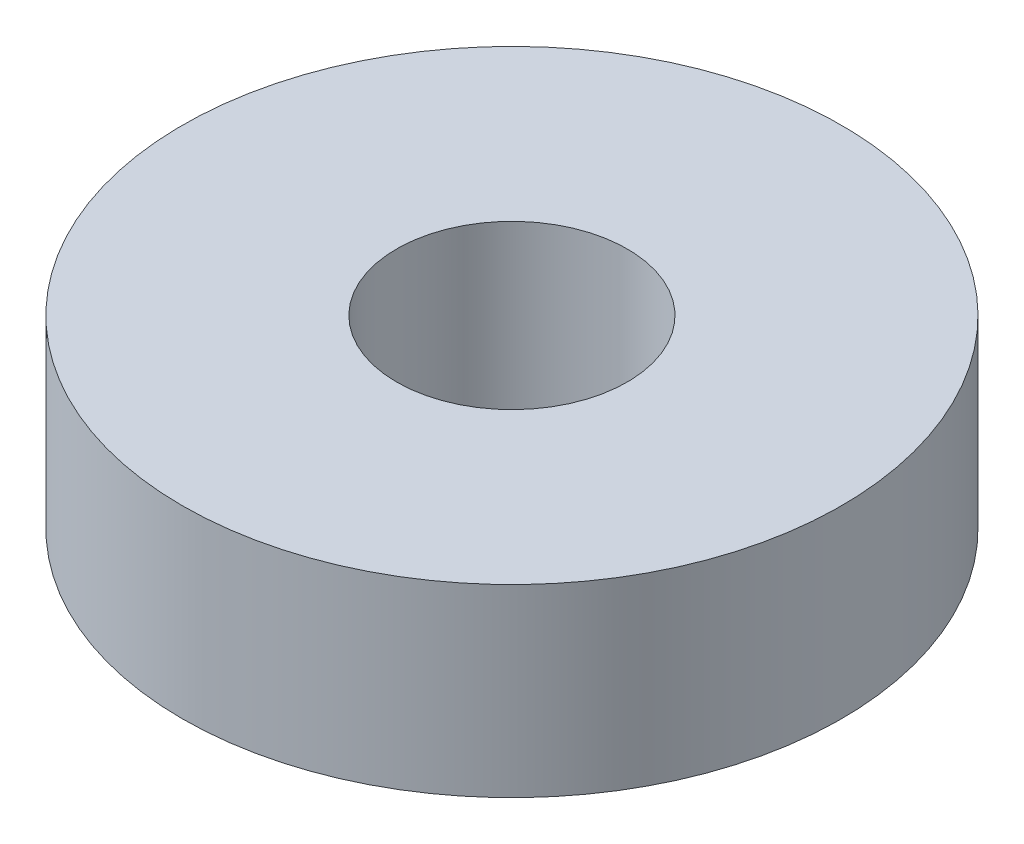
ISO-10303-21;
HEADER;
FILE_DESCRIPTION(('STEP AP214'),'2;1');
FILE_NAME('part.step','',(''),(''),'','','');
FILE_SCHEMA(('AUTOMOTIVE_DESIGN { 1 0 10303 214 1 1 1 1 }'));
ENDSEC;
DATA;
#1=APPLICATION_CONTEXT('core data for automotive mechanical design processes');
#2=APPLICATION_PROTOCOL_DEFINITION('international standard','automotive_design',2000,#1);
#3=PRODUCT_CONTEXT('',#1,'mechanical');
#4=PRODUCT('Part','Part','',(#3));
#5=PRODUCT_RELATED_PRODUCT_CATEGORY('part','',(#4));
#6=PRODUCT_DEFINITION_FORMATION('','',#4);
#7=PRODUCT_DEFINITION_CONTEXT('part definition',#1,'design');
#8=PRODUCT_DEFINITION('design','',#6,#7);
#9=PRODUCT_DEFINITION_SHAPE('','',#8);
#10=(LENGTH_UNIT() NAMED_UNIT(*) SI_UNIT(.MILLI.,.METRE.));
#11=(NAMED_UNIT(*) PLANE_ANGLE_UNIT() SI_UNIT($,.RADIAN.));
#12=(NAMED_UNIT(*) SI_UNIT($,.STERADIAN.) SOLID_ANGLE_UNIT());
#13=UNCERTAINTY_MEASURE_WITH_UNIT(LENGTH_MEASURE(1.E-05),#10,'distance_accuracy_value','');
#14=(GEOMETRIC_REPRESENTATION_CONTEXT(3) GLOBAL_UNCERTAINTY_ASSIGNED_CONTEXT((#13)) GLOBAL_UNIT_ASSIGNED_CONTEXT((#10,
#11,#12)) REPRESENTATION_CONTEXT('',''));
#15=CARTESIAN_POINT('',(0.,0.,0.));
#16=DIRECTION('',(0.,0.,1.));
#17=DIRECTION('',(1.,0.,0.));
#18=AXIS2_PLACEMENT_3D('',#15,#16,#17);
#19=CARTESIAN_POINT('',(0.,28.,0.));
#20=DIRECTION('',(0.,-1.,0.));
#21=DIRECTION('',(0.,0.,-1.));
#22=AXIS2_PLACEMENT_3D('',#19,#20,#21);
#23=CYLINDRICAL_SURFACE('',#22,50.);
#24=CARTESIAN_POINT('',(0.,28.,0.));
#25=DIRECTION('',(0.,1.,0.));
#26=DIRECTION('',(0.,0.,1.));
#27=AXIS2_PLACEMENT_3D('',#24,#25,#26);
#28=CIRCLE('',#27,50.);
#29=CARTESIAN_POINT('',(0.,28.,50.));
#30=VERTEX_POINT('',#29);
#31=EDGE_CURVE('E10',#30,#30,#28,.T.);
#32=ORIENTED_EDGE('',*,*,#31,.F.);
#33=EDGE_LOOP('',(#32));
#34=FACE_BOUND('',#33,.T.);
#35=CARTESIAN_POINT('',(0.,0.,0.));
#36=DIRECTION('',(0.,1.,0.));
#37=DIRECTION('',(0.,0.,1.));
#38=AXIS2_PLACEMENT_3D('',#35,#36,#37);
#39=CIRCLE('',#38,50.);
#40=CARTESIAN_POINT('',(0.,0.,50.));
#41=VERTEX_POINT('',#40);
#42=EDGE_CURVE('E37',#41,#41,#39,.T.);
#43=ORIENTED_EDGE('',*,*,#42,.T.);
#44=EDGE_LOOP('',(#43));
#45=FACE_BOUND('',#44,.T.);
#46=ADVANCED_FACE('F40',(#34,#45),#23,.T.);
#47=CARTESIAN_POINT('',(0.,28.,0.));
#48=DIRECTION('',(0.,1.,0.));
#49=DIRECTION('',(0.,0.,1.));
#50=AXIS2_PLACEMENT_3D('',#47,#48,#49);
#51=PLANE('',#50);
#52=CARTESIAN_POINT('',(0.,28.,0.));
#53=DIRECTION('',(0.,1.,0.));
#54=DIRECTION('',(0.,0.,1.));
#55=AXIS2_PLACEMENT_3D('',#52,#53,#54);
#56=CIRCLE('',#55,17.5);
#57=CARTESIAN_POINT('',(0.,28.,17.5));
#58=VERTEX_POINT('',#57);
#59=EDGE_CURVE('E50',#58,#58,#56,.T.);
#60=ORIENTED_EDGE('',*,*,#59,.F.);
#61=EDGE_LOOP('',(#60));
#62=FACE_BOUND('',#61,.T.);
#63=ORIENTED_EDGE('',*,*,#31,.T.);
#64=EDGE_LOOP('',(#63));
#65=FACE_BOUND('',#64,.T.);
#66=ADVANCED_FACE('F59',(#62,#65),#51,.T.);
#67=CARTESIAN_POINT('',(0.,0.,0.));
#68=DIRECTION('',(0.,1.,0.));
#69=DIRECTION('',(0.,0.,1.));
#70=AXIS2_PLACEMENT_3D('',#67,#68,#69);
#71=PLANE('',#70);
#72=CARTESIAN_POINT('',(0.,0.,0.));
#73=DIRECTION('',(0.,1.,0.));
#74=DIRECTION('',(0.,0.,1.));
#75=AXIS2_PLACEMENT_3D('',#72,#73,#74);
#76=CIRCLE('',#75,17.5);
#77=CARTESIAN_POINT('',(0.,0.,17.5));
#78=VERTEX_POINT('',#77);
#79=EDGE_CURVE('E47',#78,#78,#76,.T.);
#80=ORIENTED_EDGE('',*,*,#79,.T.);
#81=EDGE_LOOP('',(#80));
#82=FACE_BOUND('',#81,.T.);
#83=ORIENTED_EDGE('',*,*,#42,.F.);
#84=EDGE_LOOP('',(#83));
#85=FACE_BOUND('',#84,.T.);
#86=ADVANCED_FACE('F58',(#82,#85),#71,.F.);
#87=CARTESIAN_POINT('',(0.,28.,0.));
#88=DIRECTION('',(0.,-1.,0.));
#89=DIRECTION('',(0.,0.,-1.));
#90=AXIS2_PLACEMENT_3D('',#87,#88,#89);
#91=CYLINDRICAL_SURFACE('',#90,17.5);
#92=ORIENTED_EDGE('',*,*,#59,.T.);
#93=EDGE_LOOP('',(#92));
#94=FACE_BOUND('',#93,.T.);
#95=ORIENTED_EDGE('',*,*,#79,.F.);
#96=EDGE_LOOP('',(#95));
#97=FACE_BOUND('',#96,.T.);
#98=ADVANCED_FACE('F54',(#94,#97),#91,.F.);
#99=CLOSED_SHELL('',(#46,#66,#86,#98));
#100=MANIFOLD_SOLID_BREP('B2',#99);
#101=ADVANCED_BREP_SHAPE_REPRESENTATION('',(#18,#100),#14);
#102=SHAPE_DEFINITION_REPRESENTATION(#9,#101);
ENDSEC;
END-ISO-10303-21;
